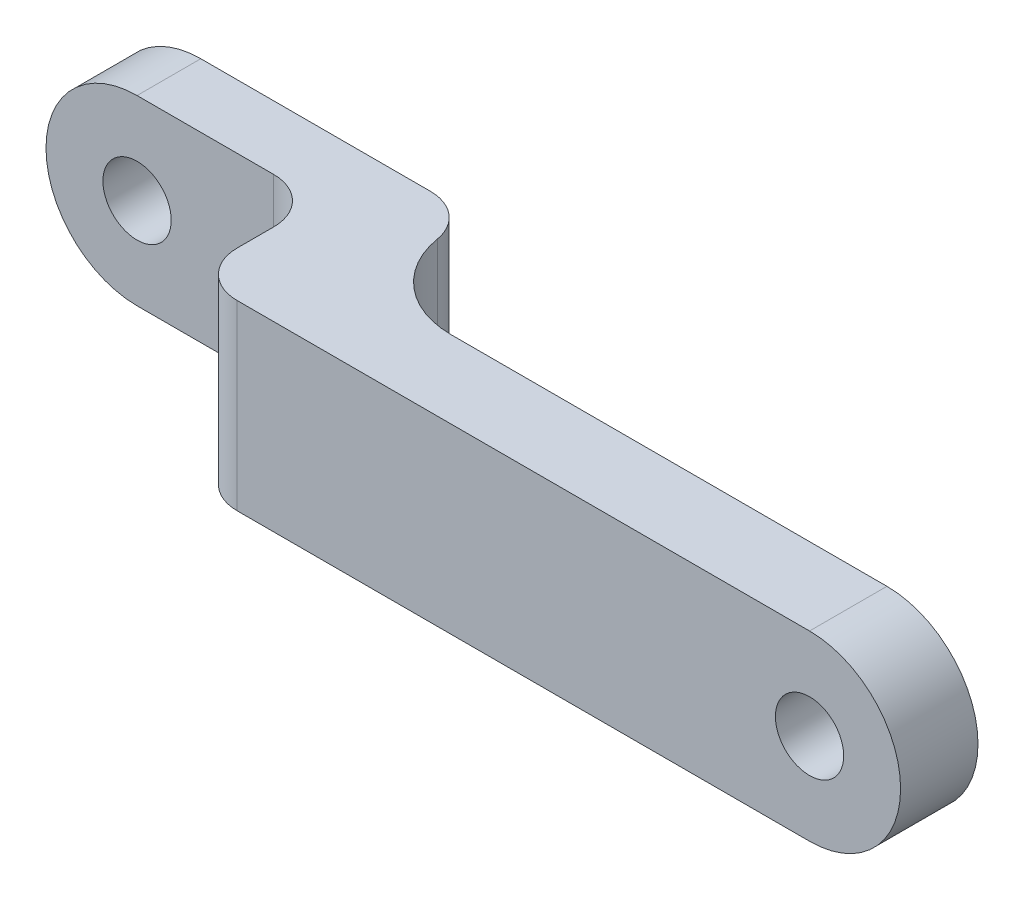
ISO-10303-21;
HEADER;
FILE_DESCRIPTION(('STEP AP214'),'2;1');
FILE_NAME('part.step','',(''),(''),'','','');
FILE_SCHEMA(('AUTOMOTIVE_DESIGN { 1 0 10303 214 1 1 1 1 }'));
ENDSEC;
DATA;
#1=APPLICATION_CONTEXT('core data for automotive mechanical design processes');
#2=APPLICATION_PROTOCOL_DEFINITION('international standard','automotive_design',2000,#1);
#3=PRODUCT_CONTEXT('',#1,'mechanical');
#4=PRODUCT('Part','Part','',(#3));
#5=PRODUCT_RELATED_PRODUCT_CATEGORY('part','',(#4));
#6=PRODUCT_DEFINITION_FORMATION('','',#4);
#7=PRODUCT_DEFINITION_CONTEXT('part definition',#1,'design');
#8=PRODUCT_DEFINITION('design','',#6,#7);
#9=PRODUCT_DEFINITION_SHAPE('','',#8);
#10=(LENGTH_UNIT() NAMED_UNIT(*) SI_UNIT(.MILLI.,.METRE.));
#11=(NAMED_UNIT(*) PLANE_ANGLE_UNIT() SI_UNIT($,.RADIAN.));
#12=(NAMED_UNIT(*) SI_UNIT($,.STERADIAN.) SOLID_ANGLE_UNIT());
#13=UNCERTAINTY_MEASURE_WITH_UNIT(LENGTH_MEASURE(1.E-05),#10,'distance_accuracy_value','');
#14=(GEOMETRIC_REPRESENTATION_CONTEXT(3) GLOBAL_UNCERTAINTY_ASSIGNED_CONTEXT((#13)) GLOBAL_UNIT_ASSIGNED_CONTEXT((#10,
#11,#12)) REPRESENTATION_CONTEXT('',''));
#15=CARTESIAN_POINT('',(0.,0.,0.));
#16=DIRECTION('',(0.,0.,1.));
#17=DIRECTION('',(1.,0.,0.));
#18=AXIS2_PLACEMENT_3D('',#15,#16,#17);
#19=CARTESIAN_POINT('',(0.,0.,0.85));
#20=DIRECTION('',(0.,0.,-1.));
#21=DIRECTION('',(-1.,0.,0.));
#22=AXIS2_PLACEMENT_3D('',#19,#20,#21);
#23=CYLINDRICAL_SURFACE('',#22,2.);
#24=CARTESIAN_POINT('',(0.,0.,-1.95));
#25=DIRECTION('',(0.,0.,-1.));
#26=DIRECTION('',(1.,0.,0.));
#27=AXIS2_PLACEMENT_3D('',#24,#25,#26);
#28=CIRCLE('',#27,2.);
#29=CARTESIAN_POINT('',(0.,-2.,-1.95));
#30=VERTEX_POINT('',#29);
#31=CARTESIAN_POINT('',(0.,2.,-1.95));
#32=VERTEX_POINT('',#31);
#33=EDGE_CURVE('E127',#30,#32,#28,.T.);
#34=ORIENTED_EDGE('',*,*,#33,.T.);
#35=DIRECTION('',(0.,0.,-1.));
#36=VECTOR('',#35,1.);
#37=CARTESIAN_POINT('',(0.,2.,0.85));
#38=LINE('',#37,#36);
#39=CARTESIAN_POINT('',(0.,2.,-3.35));
#40=VERTEX_POINT('',#39);
#41=EDGE_CURVE('E133',#32,#40,#38,.T.);
#42=ORIENTED_EDGE('',*,*,#41,.T.);
#43=CARTESIAN_POINT('',(0.,0.,-3.35));
#44=DIRECTION('',(0.,0.,1.));
#45=DIRECTION('',(-1.,0.,0.));
#46=AXIS2_PLACEMENT_3D('',#43,#44,#45);
#47=CIRCLE('',#46,2.);
#48=CARTESIAN_POINT('',(0.,-2.,-3.35));
#49=VERTEX_POINT('',#48);
#50=EDGE_CURVE('E161',#40,#49,#47,.T.);
#51=ORIENTED_EDGE('',*,*,#50,.T.);
#52=DIRECTION('',(0.,0.,-1.));
#53=VECTOR('',#52,1.);
#54=CARTESIAN_POINT('',(0.,-2.,0.85));
#55=LINE('',#54,#53);
#56=EDGE_CURVE('E146',#30,#49,#55,.T.);
#57=ORIENTED_EDGE('',*,*,#56,.F.);
#58=EDGE_LOOP('',(#34,#42,#51,#57));
#59=FACE_BOUND('',#58,.T.);
#60=ADVANCED_FACE('F37',(#59),#23,.T.);
#61=CARTESIAN_POINT('',(0.,0.,0.85));
#62=DIRECTION('',(0.,0.,-1.));
#63=DIRECTION('',(-1.,0.,0.));
#64=AXIS2_PLACEMENT_3D('',#61,#62,#63);
#65=CYLINDRICAL_SURFACE('',#64,0.75);
#66=CARTESIAN_POINT('',(0.,0.,-3.35));
#67=DIRECTION('',(0.,0.,1.));
#68=DIRECTION('',(-1.,0.,0.));
#69=AXIS2_PLACEMENT_3D('',#66,#67,#68);
#70=CIRCLE('',#69,0.75);
#71=CARTESIAN_POINT('',(-0.75,0.,-3.35));
#72=VERTEX_POINT('',#71);
#73=EDGE_CURVE('E157',#72,#72,#70,.T.);
#74=ORIENTED_EDGE('',*,*,#73,.F.);
#75=EDGE_LOOP('',(#74));
#76=FACE_BOUND('',#75,.T.);
#77=CARTESIAN_POINT('',(0.,0.,-1.95));
#78=DIRECTION('',(0.,0.,-1.));
#79=DIRECTION('',(1.,0.,0.));
#80=AXIS2_PLACEMENT_3D('',#77,#78,#79);
#81=CIRCLE('',#80,0.75);
#82=CARTESIAN_POINT('',(0.75,0.,-1.95));
#83=VERTEX_POINT('',#82);
#84=EDGE_CURVE('E147',#83,#83,#81,.T.);
#85=ORIENTED_EDGE('',*,*,#84,.F.);
#86=EDGE_LOOP('',(#85));
#87=FACE_BOUND('',#86,.T.);
#88=ADVANCED_FACE('F257',(#76,#87),#65,.F.);
#89=CARTESIAN_POINT('',(0.,0.,-0.85));
#90=DIRECTION('',(0.,0.,1.));
#91=DIRECTION('',(1.,0.,0.));
#92=AXIS2_PLACEMENT_3D('',#89,#90,#91);
#93=PLANE('',#92);
#94=CARTESIAN_POINT('',(17.57,0.,-0.85));
#95=DIRECTION('',(0.,0.,-1.));
#96=DIRECTION('',(1.,0.,0.));
#97=AXIS2_PLACEMENT_3D('',#94,#95,#96);
#98=CIRCLE('',#97,0.750000000000002);
#99=CARTESIAN_POINT('',(18.32,0.,-0.85));
#100=VERTEX_POINT('',#99);
#101=EDGE_CURVE('E167',#100,#100,#98,.T.);
#102=ORIENTED_EDGE('',*,*,#101,.F.);
#103=EDGE_LOOP('',(#102));
#104=FACE_BOUND('',#103,.T.);
#105=DIRECTION('',(1.,0.,0.));
#106=VECTOR('',#105,1.);
#107=CARTESIAN_POINT('',(0.,2.,-0.85));
#108=LINE('',#107,#106);
#109=CARTESIAN_POINT('',(8.,2.,-0.85));
#110=VERTEX_POINT('',#109);
#111=CARTESIAN_POINT('',(17.57,2.,-0.85));
#112=VERTEX_POINT('',#111);
#113=EDGE_CURVE('E171',#110,#112,#108,.T.);
#114=ORIENTED_EDGE('',*,*,#113,.T.);
#115=CARTESIAN_POINT('',(17.57,0.,-0.85));
#116=DIRECTION('',(0.,0.,-1.));
#117=DIRECTION('',(1.,0.,0.));
#118=AXIS2_PLACEMENT_3D('',#115,#116,#117);
#119=CIRCLE('',#118,2.);
#120=CARTESIAN_POINT('',(17.57,-2.,-0.85));
#121=VERTEX_POINT('',#120);
#122=EDGE_CURVE('E185',#112,#121,#119,.T.);
#123=ORIENTED_EDGE('',*,*,#122,.T.);
#124=DIRECTION('',(-1.,0.,0.));
#125=VECTOR('',#124,1.);
#126=CARTESIAN_POINT('',(0.,-2.,-0.85));
#127=LINE('',#126,#125);
#128=CARTESIAN_POINT('',(8.,-2.,-0.85));
#129=VERTEX_POINT('',#128);
#130=EDGE_CURVE('E177',#121,#129,#127,.T.);
#131=ORIENTED_EDGE('',*,*,#130,.T.);
#132=DIRECTION('',(0.,1.,0.));
#133=VECTOR('',#132,1.);
#134=CARTESIAN_POINT('',(8.,-2.,-0.85));
#135=LINE('',#134,#133);
#136=EDGE_CURVE('E141',#110,#129,#135,.F.);
#137=ORIENTED_EDGE('',*,*,#136,.F.);
#138=EDGE_LOOP('',(#114,#123,#131,#137));
#139=FACE_BOUND('',#138,.T.);
#140=ADVANCED_FACE('F243',(#104,#139),#93,.F.);
#141=CARTESIAN_POINT('',(0.,0.,0.85));
#142=DIRECTION('',(0.,0.,1.));
#143=DIRECTION('',(1.,0.,0.));
#144=AXIS2_PLACEMENT_3D('',#141,#142,#143);
#145=PLANE('',#144);
#146=DIRECTION('',(-1.,0.,0.));
#147=VECTOR('',#146,1.);
#148=CARTESIAN_POINT('',(0.,-2.,0.85));
#149=LINE('',#148,#147);
#150=CARTESIAN_POINT('',(17.57,-2.,0.85));
#151=VERTEX_POINT('',#150);
#152=CARTESIAN_POINT('',(5.,-2.,0.85));
#153=VERTEX_POINT('',#152);
#154=EDGE_CURVE('E180',#151,#153,#149,.T.);
#155=ORIENTED_EDGE('',*,*,#154,.F.);
#156=CARTESIAN_POINT('',(17.57,0.,0.85));
#157=DIRECTION('',(0.,0.,-1.));
#158=DIRECTION('',(1.,0.,0.));
#159=AXIS2_PLACEMENT_3D('',#156,#157,#158);
#160=CIRCLE('',#159,2.);
#161=CARTESIAN_POINT('',(17.57,2.,0.85));
#162=VERTEX_POINT('',#161);
#163=EDGE_CURVE('E176',#162,#151,#160,.T.);
#164=ORIENTED_EDGE('',*,*,#163,.F.);
#165=DIRECTION('',(1.,0.,0.));
#166=VECTOR('',#165,1.);
#167=CARTESIAN_POINT('',(0.,2.,0.85));
#168=LINE('',#167,#166);
#169=CARTESIAN_POINT('',(5.,2.,0.85));
#170=VERTEX_POINT('',#169);
#171=EDGE_CURVE('E174',#170,#162,#168,.T.);
#172=ORIENTED_EDGE('',*,*,#171,.F.);
#173=DIRECTION('',(0.,-1.,0.));
#174=VECTOR('',#173,1.);
#175=CARTESIAN_POINT('',(5.,2.,0.85));
#176=LINE('',#175,#174);
#177=EDGE_CURVE('E217',#153,#170,#176,.F.);
#178=ORIENTED_EDGE('',*,*,#177,.F.);
#179=EDGE_LOOP('',(#155,#164,#172,#178));
#180=FACE_BOUND('',#179,.T.);
#181=CARTESIAN_POINT('',(17.57,0.,0.85));
#182=DIRECTION('',(0.,0.,-1.));
#183=DIRECTION('',(1.,0.,0.));
#184=AXIS2_PLACEMENT_3D('',#181,#182,#183);
#185=CIRCLE('',#184,0.750000000000002);
#186=CARTESIAN_POINT('',(18.32,0.,0.85));
#187=VERTEX_POINT('',#186);
#188=EDGE_CURVE('E168',#187,#187,#185,.T.);
#189=ORIENTED_EDGE('',*,*,#188,.T.);
#190=EDGE_LOOP('',(#189));
#191=FACE_BOUND('',#190,.T.);
#192=ADVANCED_FACE('F233',(#180,#191),#145,.T.);
#193=CARTESIAN_POINT('',(0.,2.,0.85));
#194=DIRECTION('',(0.,-1.,0.));
#195=DIRECTION('',(0.,0.,1.));
#196=AXIS2_PLACEMENT_3D('',#193,#194,#195);
#197=PLANE('',#196);
#198=ORIENTED_EDGE('',*,*,#171,.T.);
#199=DIRECTION('',(0.,0.,-1.));
#200=VECTOR('',#199,1.);
#201=CARTESIAN_POINT('',(17.57,2.,0.85));
#202=LINE('',#201,#200);
#203=EDGE_CURVE('E142',#162,#112,#202,.T.);
#204=ORIENTED_EDGE('',*,*,#203,.T.);
#205=ORIENTED_EDGE('',*,*,#113,.F.);
#206=CARTESIAN_POINT('',(8.,2.,-2.85));
#207=DIRECTION('',(0.,1.,0.));
#208=DIRECTION('',(0.,0.,1.));
#209=AXIS2_PLACEMENT_3D('',#206,#207,#208);
#210=CIRCLE('',#209,2.);
#211=CARTESIAN_POINT('',(6.02797340563346,2.,-2.51666666666667));
#212=VERTEX_POINT('',#211);
#213=EDGE_CURVE('E196',#212,#110,#210,.T.);
#214=ORIENTED_EDGE('',*,*,#213,.F.);
#215=CARTESIAN_POINT('',(5.04196010845019,2.,-2.35));
#216=DIRECTION('',(0.,1.,0.));
#217=DIRECTION('',(0.,0.,1.));
#218=AXIS2_PLACEMENT_3D('',#215,#216,#217);
#219=CIRCLE('',#218,1.);
#220=CARTESIAN_POINT('',(5.04196010845019,2.,-3.35));
#221=VERTEX_POINT('',#220);
#222=EDGE_CURVE('E203',#221,#212,#219,.F.);
#223=ORIENTED_EDGE('',*,*,#222,.F.);
#224=DIRECTION('',(-1.,0.,0.));
#225=VECTOR('',#224,1.);
#226=CARTESIAN_POINT('',(6.,2.,-3.35));
#227=LINE('',#226,#225);
#228=EDGE_CURVE('E137',#221,#40,#227,.T.);
#229=ORIENTED_EDGE('',*,*,#228,.T.);
#230=ORIENTED_EDGE('',*,*,#41,.F.);
#231=DIRECTION('',(1.,0.,0.));
#232=VECTOR('',#231,1.);
#233=CARTESIAN_POINT('',(0.,2.,-1.95));
#234=LINE('',#233,#232);
#235=CARTESIAN_POINT('',(3.,2.,-1.95));
#236=VERTEX_POINT('',#235);
#237=EDGE_CURVE('E122',#32,#236,#234,.T.);
#238=ORIENTED_EDGE('',*,*,#237,.T.);
#239=CARTESIAN_POINT('',(3.,2.,-0.95));
#240=DIRECTION('',(0.,1.,0.));
#241=DIRECTION('',(0.,0.,1.));
#242=AXIS2_PLACEMENT_3D('',#239,#240,#241);
#243=CIRCLE('',#242,1.);
#244=CARTESIAN_POINT('',(4.,2.,-0.95));
#245=VERTEX_POINT('',#244);
#246=EDGE_CURVE('E11',#245,#236,#243,.T.);
#247=ORIENTED_EDGE('',*,*,#246,.F.);
#248=DIRECTION('',(0.,0.,1.));
#249=VECTOR('',#248,1.);
#250=CARTESIAN_POINT('',(4.,2.,-1.95));
#251=LINE('',#250,#249);
#252=CARTESIAN_POINT('',(4.,2.,-0.15));
#253=VERTEX_POINT('',#252);
#254=EDGE_CURVE('E153',#245,#253,#251,.T.);
#255=ORIENTED_EDGE('',*,*,#254,.T.);
#256=CARTESIAN_POINT('',(5.,2.,-0.15));
#257=DIRECTION('',(0.,1.,0.));
#258=DIRECTION('',(0.,0.,1.));
#259=AXIS2_PLACEMENT_3D('',#256,#257,#258);
#260=CIRCLE('',#259,1.);
#261=EDGE_CURVE('E52',#170,#253,#260,.F.);
#262=ORIENTED_EDGE('',*,*,#261,.F.);
#263=EDGE_LOOP('',(#198,#204,#205,#214,#223,#229,#230,#238,#247,#255,#262));
#264=FACE_BOUND('',#263,.T.);
#265=ADVANCED_FACE('F134',(#264),#197,.F.);
#266=CARTESIAN_POINT('',(17.57,0.,0.85));
#267=DIRECTION('',(0.,0.,-1.));
#268=DIRECTION('',(-1.,0.,0.));
#269=AXIS2_PLACEMENT_3D('',#266,#267,#268);
#270=CYLINDRICAL_SURFACE('',#269,2.);
#271=ORIENTED_EDGE('',*,*,#122,.F.);
#272=ORIENTED_EDGE('',*,*,#203,.F.);
#273=ORIENTED_EDGE('',*,*,#163,.T.);
#274=DIRECTION('',(0.,0.,-1.));
#275=VECTOR('',#274,1.);
#276=CARTESIAN_POINT('',(17.57,-2.,0.85));
#277=LINE('',#276,#275);
#278=EDGE_CURVE('E191',#151,#121,#277,.T.);
#279=ORIENTED_EDGE('',*,*,#278,.T.);
#280=EDGE_LOOP('',(#271,#272,#273,#279));
#281=FACE_BOUND('',#280,.T.);
#282=ADVANCED_FACE('F239',(#281),#270,.T.);
#283=CARTESIAN_POINT('',(0.,-2.,0.85));
#284=DIRECTION('',(0.,1.,0.));
#285=DIRECTION('',(0.,0.,-1.));
#286=AXIS2_PLACEMENT_3D('',#283,#284,#285);
#287=PLANE('',#286);
#288=DIRECTION('',(0.,0.,1.));
#289=VECTOR('',#288,1.);
#290=CARTESIAN_POINT('',(4.,-2.,-1.95));
#291=LINE('',#290,#289);
#292=CARTESIAN_POINT('',(4.,-2.,-0.95));
#293=VERTEX_POINT('',#292);
#294=CARTESIAN_POINT('',(4.,-2.,-0.15));
#295=VERTEX_POINT('',#294);
#296=EDGE_CURVE('E154',#293,#295,#291,.T.);
#297=ORIENTED_EDGE('',*,*,#296,.F.);
#298=CARTESIAN_POINT('',(3.,-2.,-0.95));
#299=DIRECTION('',(0.,-1.,0.));
#300=DIRECTION('',(0.,0.,-1.));
#301=AXIS2_PLACEMENT_3D('',#298,#299,#300);
#302=CIRCLE('',#301,1.);
#303=CARTESIAN_POINT('',(3.,-2.,-1.95));
#304=VERTEX_POINT('',#303);
#305=EDGE_CURVE('E45',#304,#293,#302,.T.);
#306=ORIENTED_EDGE('',*,*,#305,.F.);
#307=DIRECTION('',(-1.,0.,0.));
#308=VECTOR('',#307,1.);
#309=CARTESIAN_POINT('',(4.,-2.,-1.95));
#310=LINE('',#309,#308);
#311=EDGE_CURVE('E130',#304,#30,#310,.T.);
#312=ORIENTED_EDGE('',*,*,#311,.T.);
#313=ORIENTED_EDGE('',*,*,#56,.T.);
#314=DIRECTION('',(1.,0.,0.));
#315=VECTOR('',#314,1.);
#316=CARTESIAN_POINT('',(0.,-2.,-3.35));
#317=LINE('',#316,#315);
#318=CARTESIAN_POINT('',(5.04196010845019,-2.,-3.35));
#319=VERTEX_POINT('',#318);
#320=EDGE_CURVE('E163',#49,#319,#317,.T.);
#321=ORIENTED_EDGE('',*,*,#320,.T.);
#322=CARTESIAN_POINT('',(5.04196010845019,-2.,-2.35));
#323=DIRECTION('',(0.,-1.,0.));
#324=DIRECTION('',(0.,0.,-1.));
#325=AXIS2_PLACEMENT_3D('',#322,#323,#324);
#326=CIRCLE('',#325,1.);
#327=CARTESIAN_POINT('',(6.02797340563346,-2.,-2.51666666666667));
#328=VERTEX_POINT('',#327);
#329=EDGE_CURVE('E208',#328,#319,#326,.F.);
#330=ORIENTED_EDGE('',*,*,#329,.F.);
#331=CARTESIAN_POINT('',(8.,-2.,-2.85));
#332=DIRECTION('',(0.,-1.,0.));
#333=DIRECTION('',(0.,0.,-1.));
#334=AXIS2_PLACEMENT_3D('',#331,#332,#333);
#335=CIRCLE('',#334,2.);
#336=EDGE_CURVE('E198',#129,#328,#335,.T.);
#337=ORIENTED_EDGE('',*,*,#336,.F.);
#338=ORIENTED_EDGE('',*,*,#130,.F.);
#339=ORIENTED_EDGE('',*,*,#278,.F.);
#340=ORIENTED_EDGE('',*,*,#154,.T.);
#341=CARTESIAN_POINT('',(5.,-2.,-0.15));
#342=DIRECTION('',(0.,-1.,0.));
#343=DIRECTION('',(0.,0.,-1.));
#344=AXIS2_PLACEMENT_3D('',#341,#342,#343);
#345=CIRCLE('',#344,1.);
#346=EDGE_CURVE('E59',#295,#153,#345,.F.);
#347=ORIENTED_EDGE('',*,*,#346,.F.);
#348=EDGE_LOOP('',(#297,#306,#312,#313,#321,#330,#337,#338,#339,#340,#347));
#349=FACE_BOUND('',#348,.T.);
#350=ADVANCED_FACE('F226',(#349),#287,.F.);
#351=CARTESIAN_POINT('',(17.57,0.,0.85));
#352=DIRECTION('',(0.,0.,-1.));
#353=DIRECTION('',(-1.,0.,0.));
#354=AXIS2_PLACEMENT_3D('',#351,#352,#353);
#355=CYLINDRICAL_SURFACE('',#354,0.750000000000002);
#356=ORIENTED_EDGE('',*,*,#188,.F.);
#357=EDGE_LOOP('',(#356));
#358=FACE_BOUND('',#357,.T.);
#359=ORIENTED_EDGE('',*,*,#101,.T.);
#360=EDGE_LOOP('',(#359));
#361=FACE_BOUND('',#360,.T.);
#362=ADVANCED_FACE('F253',(#358,#361),#355,.F.);
#363=CARTESIAN_POINT('',(0.,0.,-3.35));
#364=DIRECTION('',(0.,0.,-1.));
#365=DIRECTION('',(-1.,0.,0.));
#366=AXIS2_PLACEMENT_3D('',#363,#364,#365);
#367=PLANE('',#366);
#368=ORIENTED_EDGE('',*,*,#320,.F.);
#369=ORIENTED_EDGE('',*,*,#50,.F.);
#370=ORIENTED_EDGE('',*,*,#228,.F.);
#371=DIRECTION('',(0.,1.,0.));
#372=VECTOR('',#371,1.);
#373=CARTESIAN_POINT('',(5.04196010845019,2.,-3.35));
#374=LINE('',#373,#372);
#375=EDGE_CURVE('E201',#319,#221,#374,.T.);
#376=ORIENTED_EDGE('',*,*,#375,.F.);
#377=EDGE_LOOP('',(#368,#369,#370,#376));
#378=FACE_BOUND('',#377,.T.);
#379=ORIENTED_EDGE('',*,*,#73,.T.);
#380=EDGE_LOOP('',(#379));
#381=FACE_BOUND('',#380,.T.);
#382=ADVANCED_FACE('F250',(#378,#381),#367,.T.);
#383=CARTESIAN_POINT('',(4.,-2.,-1.95));
#384=DIRECTION('',(1.,0.,0.));
#385=DIRECTION('',(0.,0.,-1.));
#386=AXIS2_PLACEMENT_3D('',#383,#384,#385);
#387=PLANE('',#386);
#388=ORIENTED_EDGE('',*,*,#296,.T.);
#389=DIRECTION('',(0.,-1.,0.));
#390=VECTOR('',#389,1.);
#391=CARTESIAN_POINT('',(4.,-2.,-0.15));
#392=LINE('',#391,#390);
#393=EDGE_CURVE('E212',#253,#295,#392,.T.);
#394=ORIENTED_EDGE('',*,*,#393,.F.);
#395=ORIENTED_EDGE('',*,*,#254,.F.);
#396=DIRECTION('',(0.,-1.,0.));
#397=VECTOR('',#396,1.);
#398=CARTESIAN_POINT('',(4.,-2.,-0.95));
#399=LINE('',#398,#397);
#400=EDGE_CURVE('E214',#293,#245,#399,.F.);
#401=ORIENTED_EDGE('',*,*,#400,.F.);
#402=EDGE_LOOP('',(#388,#394,#395,#401));
#403=FACE_BOUND('',#402,.T.);
#404=ADVANCED_FACE('F228',(#403),#387,.F.);
#405=CARTESIAN_POINT('',(0.,0.,-1.95));
#406=DIRECTION('',(0.,0.,1.));
#407=DIRECTION('',(1.,0.,0.));
#408=AXIS2_PLACEMENT_3D('',#405,#406,#407);
#409=PLANE('',#408);
#410=ORIENTED_EDGE('',*,*,#84,.T.);
#411=EDGE_LOOP('',(#410));
#412=FACE_BOUND('',#411,.T.);
#413=ORIENTED_EDGE('',*,*,#237,.F.);
#414=ORIENTED_EDGE('',*,*,#33,.F.);
#415=ORIENTED_EDGE('',*,*,#311,.F.);
#416=DIRECTION('',(0.,-1.,0.));
#417=VECTOR('',#416,1.);
#418=CARTESIAN_POINT('',(3.,0.,-1.95));
#419=LINE('',#418,#417);
#420=EDGE_CURVE('E128',#236,#304,#419,.T.);
#421=ORIENTED_EDGE('',*,*,#420,.F.);
#422=EDGE_LOOP('',(#413,#414,#415,#421));
#423=FACE_BOUND('',#422,.T.);
#424=ADVANCED_FACE('F124',(#412,#423),#409,.T.);
#425=CARTESIAN_POINT('',(8.,-2.,-2.85));
#426=DIRECTION('',(0.,-1.,0.));
#427=DIRECTION('',(0.,0.,1.));
#428=AXIS2_PLACEMENT_3D('',#425,#426,#427);
#429=CYLINDRICAL_SURFACE('',#428,2.);
#430=ORIENTED_EDGE('',*,*,#213,.T.);
#431=ORIENTED_EDGE('',*,*,#136,.T.);
#432=ORIENTED_EDGE('',*,*,#336,.T.);
#433=DIRECTION('',(0.,-1.,0.));
#434=VECTOR('',#433,1.);
#435=CARTESIAN_POINT('',(6.02797340563346,-2.,-2.51666666666667));
#436=LINE('',#435,#434);
#437=EDGE_CURVE('E206',#212,#328,#436,.T.);
#438=ORIENTED_EDGE('',*,*,#437,.F.);
#439=EDGE_LOOP('',(#430,#431,#432,#438));
#440=FACE_BOUND('',#439,.T.);
#441=ADVANCED_FACE('F245',(#440),#429,.F.);
#442=CARTESIAN_POINT('',(5.04196010845019,-2.,-2.35));
#443=DIRECTION('',(0.,-1.,0.));
#444=DIRECTION('',(0.,0.,1.));
#445=AXIS2_PLACEMENT_3D('',#442,#443,#444);
#446=CYLINDRICAL_SURFACE('',#445,1.);
#447=ORIENTED_EDGE('',*,*,#329,.T.);
#448=ORIENTED_EDGE('',*,*,#375,.T.);
#449=ORIENTED_EDGE('',*,*,#222,.T.);
#450=ORIENTED_EDGE('',*,*,#437,.T.);
#451=EDGE_LOOP('',(#447,#448,#449,#450));
#452=FACE_BOUND('',#451,.T.);
#453=ADVANCED_FACE('F248',(#452),#446,.T.);
#454=CARTESIAN_POINT('',(3.,0.,-0.95));
#455=DIRECTION('',(0.,-1.,0.));
#456=DIRECTION('',(0.,0.,1.));
#457=AXIS2_PLACEMENT_3D('',#454,#455,#456);
#458=CYLINDRICAL_SURFACE('',#457,1.);
#459=ORIENTED_EDGE('',*,*,#246,.T.);
#460=ORIENTED_EDGE('',*,*,#420,.T.);
#461=ORIENTED_EDGE('',*,*,#305,.T.);
#462=ORIENTED_EDGE('',*,*,#400,.T.);
#463=EDGE_LOOP('',(#459,#460,#461,#462));
#464=FACE_BOUND('',#463,.T.);
#465=ADVANCED_FACE('F223',(#464),#458,.F.);
#466=CARTESIAN_POINT('',(5.,-2.,-0.15));
#467=DIRECTION('',(0.,1.,0.));
#468=DIRECTION('',(0.,0.,-1.));
#469=AXIS2_PLACEMENT_3D('',#466,#467,#468);
#470=CYLINDRICAL_SURFACE('',#469,1.);
#471=ORIENTED_EDGE('',*,*,#261,.T.);
#472=ORIENTED_EDGE('',*,*,#393,.T.);
#473=ORIENTED_EDGE('',*,*,#346,.T.);
#474=ORIENTED_EDGE('',*,*,#177,.T.);
#475=EDGE_LOOP('',(#471,#472,#473,#474));
#476=FACE_BOUND('',#475,.T.);
#477=ADVANCED_FACE('F39',(#476),#470,.T.);
#478=CLOSED_SHELL('',(#60,#88,#140,#192,#265,#282,#350,#362,#382,#404,#424,#441,#453,#465,#477));
#479=MANIFOLD_SOLID_BREP('B2',#478);
#480=ADVANCED_BREP_SHAPE_REPRESENTATION('',(#18,#479),#14);
#481=SHAPE_DEFINITION_REPRESENTATION(#9,#480);
ENDSEC;
END-ISO-10303-21;
